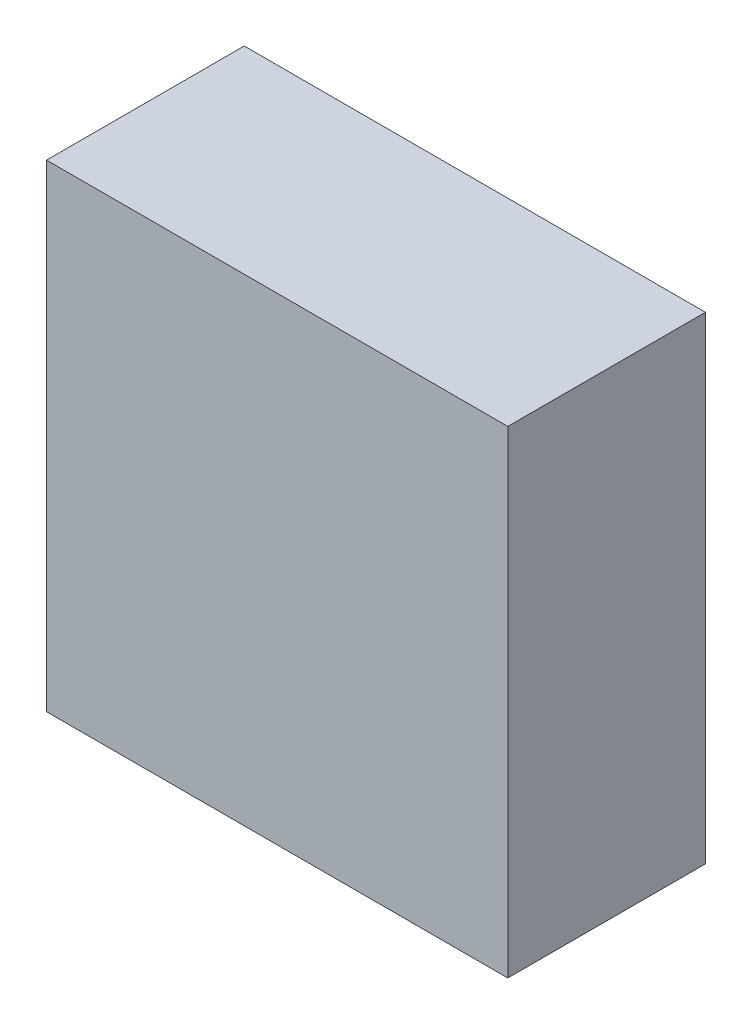
ISO-10303-21;
HEADER;
FILE_DESCRIPTION(('STEP AP214'),'2;1');
FILE_NAME('part.step','',(''),(''),'','','');
FILE_SCHEMA(('AUTOMOTIVE_DESIGN { 1 0 10303 214 1 1 1 1 }'));
ENDSEC;
DATA;
#1=APPLICATION_CONTEXT('core data for automotive mechanical design processes');
#2=APPLICATION_PROTOCOL_DEFINITION('international standard','automotive_design',2000,#1);
#3=PRODUCT_CONTEXT('',#1,'mechanical');
#4=PRODUCT('Part','Part','',(#3));
#5=PRODUCT_RELATED_PRODUCT_CATEGORY('part','',(#4));
#6=PRODUCT_DEFINITION_FORMATION('','',#4);
#7=PRODUCT_DEFINITION_CONTEXT('part definition',#1,'design');
#8=PRODUCT_DEFINITION('design','',#6,#7);
#9=PRODUCT_DEFINITION_SHAPE('','',#8);
#10=(LENGTH_UNIT() NAMED_UNIT(*) SI_UNIT(.MILLI.,.METRE.));
#11=(NAMED_UNIT(*) PLANE_ANGLE_UNIT() SI_UNIT($,.RADIAN.));
#12=(NAMED_UNIT(*) SI_UNIT($,.STERADIAN.) SOLID_ANGLE_UNIT());
#13=UNCERTAINTY_MEASURE_WITH_UNIT(LENGTH_MEASURE(1.E-05),#10,'distance_accuracy_value','');
#14=(GEOMETRIC_REPRESENTATION_CONTEXT(3) GLOBAL_UNCERTAINTY_ASSIGNED_CONTEXT((#13)) GLOBAL_UNIT_ASSIGNED_CONTEXT((#10,
#11,#12)) REPRESENTATION_CONTEXT('',''));
#15=CARTESIAN_POINT('',(0.,0.,0.));
#16=DIRECTION('',(0.,0.,1.));
#17=DIRECTION('',(1.,0.,0.));
#18=AXIS2_PLACEMENT_3D('',#15,#16,#17);
#19=CARTESIAN_POINT('',(-0.70000575499374,0.725001643861503,0.));
#20=DIRECTION('',(-1.,4.37113882867379E-08,0.));
#21=DIRECTION('',(-4.37113882867379E-08,-1.,0.));
#22=AXIS2_PLACEMENT_3D('',#19,#20,#21);
#23=PLANE('',#22);
#24=DIRECTION('',(-4.37113882660258E-08,-0.999999999999999,0.));
#25=VECTOR('',#24,1.);
#26=CARTESIAN_POINT('',(-0.70000575499374,0.725001643861503,0.));
#27=LINE('',#26,#25);
#28=CARTESIAN_POINT('',(-0.70000575499374,0.725001643861503,0.));
#29=VERTEX_POINT('',#28);
#30=CARTESIAN_POINT('',(-0.700005818375118,-0.724995304380684,0.));
#31=VERTEX_POINT('',#30);
#32=EDGE_CURVE('E11',#29,#31,#27,.T.);
#33=ORIENTED_EDGE('',*,*,#32,.T.);
#34=DIRECTION('',(0.,0.,1.));
#35=VECTOR('',#34,1.);
#36=CARTESIAN_POINT('',(-0.700005818375119,-0.724995304380684,0.));
#37=LINE('',#36,#35);
#38=CARTESIAN_POINT('',(-0.700005818375118,-0.724995304380684,0.599998772144318));
#39=VERTEX_POINT('',#38);
#40=EDGE_CURVE('E88',#31,#39,#37,.T.);
#41=ORIENTED_EDGE('',*,*,#40,.T.);
#42=DIRECTION('',(-4.37113882660258E-08,-0.999999999999999,0.));
#43=VECTOR('',#42,1.);
#44=CARTESIAN_POINT('',(-0.70000575499374,0.725001643861503,0.599998772144318));
#45=LINE('',#44,#43);
#46=CARTESIAN_POINT('',(-0.70000575499374,0.725001643861503,0.599998772144318));
#47=VERTEX_POINT('',#46);
#48=EDGE_CURVE('E83',#47,#39,#45,.T.);
#49=ORIENTED_EDGE('',*,*,#48,.F.);
#50=DIRECTION('',(0.,0.,1.));
#51=VECTOR('',#50,1.);
#52=CARTESIAN_POINT('',(-0.70000575499374,0.725001643861502,0.));
#53=LINE('',#52,#51);
#54=EDGE_CURVE('E72',#29,#47,#53,.T.);
#55=ORIENTED_EDGE('',*,*,#54,.F.);
#56=EDGE_LOOP('',(#33,#41,#49,#55));
#57=FACE_BOUND('',#56,.T.);
#58=ADVANCED_FACE('F17',(#57),#23,.T.);
#59=CARTESIAN_POINT('',(-0.700005818375118,-0.724995304380684,0.));
#60=DIRECTION('',(-4.37113882867379E-08,-1.,0.));
#61=DIRECTION('',(1.,-4.37113882867379E-08,0.));
#62=AXIS2_PLACEMENT_3D('',#59,#60,#61);
#63=PLANE('',#62);
#64=DIRECTION('',(0.999999999999999,-4.37113882717915E-08,0.));
#65=VECTOR('',#64,1.);
#66=CARTESIAN_POINT('',(-0.700005818375118,-0.724995304380684,0.));
#67=LINE('',#66,#65);
#68=CARTESIAN_POINT('',(0.70000333689832,-0.72499536557703,0.));
#69=VERTEX_POINT('',#68);
#70=EDGE_CURVE('E24',#31,#69,#67,.T.);
#71=ORIENTED_EDGE('',*,*,#70,.T.);
#72=DIRECTION('',(0.,0.,1.));
#73=VECTOR('',#72,1.);
#74=CARTESIAN_POINT('',(0.70000333689832,-0.724995365577028,0.));
#75=LINE('',#74,#73);
#76=CARTESIAN_POINT('',(0.70000333689832,-0.72499536557703,0.599998772144318));
#77=VERTEX_POINT('',#76);
#78=EDGE_CURVE('E85',#69,#77,#75,.T.);
#79=ORIENTED_EDGE('',*,*,#78,.T.);
#80=DIRECTION('',(0.999999999999999,-4.37113882717915E-08,0.));
#81=VECTOR('',#80,1.);
#82=CARTESIAN_POINT('',(-0.700005818375118,-0.724995304380684,0.599998772144318));
#83=LINE('',#82,#81);
#84=EDGE_CURVE('E66',#39,#77,#83,.T.);
#85=ORIENTED_EDGE('',*,*,#84,.F.);
#86=ORIENTED_EDGE('',*,*,#40,.F.);
#87=EDGE_LOOP('',(#71,#79,#85,#86));
#88=FACE_BOUND('',#87,.T.);
#89=ADVANCED_FACE('F89',(#88),#63,.T.);
#90=CARTESIAN_POINT('',(0.70000333689832,-0.72499536557703,0.));
#91=DIRECTION('',(1.,-4.37113882867379E-08,0.));
#92=DIRECTION('',(4.37113882867379E-08,1.,0.));
#93=AXIS2_PLACEMENT_3D('',#90,#91,#92);
#94=PLANE('',#93);
#95=DIRECTION('',(4.37113882660258E-08,0.999999999999999,0.));
#96=VECTOR('',#95,1.);
#97=CARTESIAN_POINT('',(0.70000333689832,-0.72499536557703,0.));
#98=LINE('',#97,#96);
#99=CARTESIAN_POINT('',(0.700003400279698,0.725001582665158,0.));
#100=VERTEX_POINT('',#99);
#101=EDGE_CURVE('E62',#69,#100,#98,.T.);
#102=ORIENTED_EDGE('',*,*,#101,.T.);
#103=DIRECTION('',(0.,0.,1.));
#104=VECTOR('',#103,1.);
#105=CARTESIAN_POINT('',(0.700003400279699,0.725001582665158,0.));
#106=LINE('',#105,#104);
#107=CARTESIAN_POINT('',(0.700003400279698,0.725001582665158,0.599998772144318));
#108=VERTEX_POINT('',#107);
#109=EDGE_CURVE('E55',#100,#108,#106,.T.);
#110=ORIENTED_EDGE('',*,*,#109,.T.);
#111=DIRECTION('',(4.37113882660258E-08,0.999999999999999,0.));
#112=VECTOR('',#111,1.);
#113=CARTESIAN_POINT('',(0.70000333689832,-0.72499536557703,0.599998772144318));
#114=LINE('',#113,#112);
#115=EDGE_CURVE('E59',#77,#108,#114,.T.);
#116=ORIENTED_EDGE('',*,*,#115,.F.);
#117=ORIENTED_EDGE('',*,*,#78,.F.);
#118=EDGE_LOOP('',(#102,#110,#116,#117));
#119=FACE_BOUND('',#118,.T.);
#120=ADVANCED_FACE('F57',(#119),#94,.T.);
#121=CARTESIAN_POINT('',(0.700003400279698,0.725001582665158,0.));
#122=DIRECTION('',(4.37113882867379E-08,1.,0.));
#123=DIRECTION('',(-1.,4.37113882867379E-08,0.));
#124=AXIS2_PLACEMENT_3D('',#121,#122,#123);
#125=PLANE('',#124);
#126=DIRECTION('',(-0.999999999999999,4.37113882717915E-08,0.));
#127=VECTOR('',#126,1.);
#128=CARTESIAN_POINT('',(0.700003400279698,0.725001582665158,0.));
#129=LINE('',#128,#127);
#130=EDGE_CURVE('E65',#100,#29,#129,.T.);
#131=ORIENTED_EDGE('',*,*,#130,.T.);
#132=ORIENTED_EDGE('',*,*,#54,.T.);
#133=DIRECTION('',(-0.999999999999999,4.37113882717915E-08,0.));
#134=VECTOR('',#133,1.);
#135=CARTESIAN_POINT('',(0.700003400279698,0.725001582665158,0.599998772144318));
#136=LINE('',#135,#134);
#137=EDGE_CURVE('E70',#108,#47,#136,.T.);
#138=ORIENTED_EDGE('',*,*,#137,.F.);
#139=ORIENTED_EDGE('',*,*,#109,.F.);
#140=EDGE_LOOP('',(#131,#132,#138,#139));
#141=FACE_BOUND('',#140,.T.);
#142=ADVANCED_FACE('F71',(#141),#125,.T.);
#143=CARTESIAN_POINT('',(-102.724990844727,202.199996948242,0.599998772144318));
#144=DIRECTION('',(0.,0.,1.));
#145=DIRECTION('',(-4.37113882867379E-08,-1.,0.));
#146=AXIS2_PLACEMENT_3D('',#143,#144,#145);
#147=PLANE('',#146);
#148=ORIENTED_EDGE('',*,*,#48,.T.);
#149=ORIENTED_EDGE('',*,*,#84,.T.);
#150=ORIENTED_EDGE('',*,*,#115,.T.);
#151=ORIENTED_EDGE('',*,*,#137,.T.);
#152=EDGE_LOOP('',(#148,#149,#150,#151));
#153=FACE_BOUND('',#152,.T.);
#154=ADVANCED_FACE('F76',(#153),#147,.T.);
#155=CARTESIAN_POINT('',(-102.724990844727,202.199996948242,0.));
#156=DIRECTION('',(0.,0.,1.));
#157=DIRECTION('',(-4.37113882867379E-08,-1.,0.));
#158=AXIS2_PLACEMENT_3D('',#155,#156,#157);
#159=PLANE('',#158);
#160=ORIENTED_EDGE('',*,*,#130,.F.);
#161=ORIENTED_EDGE('',*,*,#101,.F.);
#162=ORIENTED_EDGE('',*,*,#70,.F.);
#163=ORIENTED_EDGE('',*,*,#32,.F.);
#164=EDGE_LOOP('',(#160,#161,#162,#163));
#165=FACE_BOUND('',#164,.T.);
#166=ADVANCED_FACE('F91',(#165),#159,.F.);
#167=CLOSED_SHELL('',(#58,#89,#120,#142,#154,#166));
#168=MANIFOLD_SOLID_BREP('B1',#167);
#169=ADVANCED_BREP_SHAPE_REPRESENTATION('',(#18,#168),#14);
#170=SHAPE_DEFINITION_REPRESENTATION(#9,#169);
ENDSEC;
END-ISO-10303-21;
